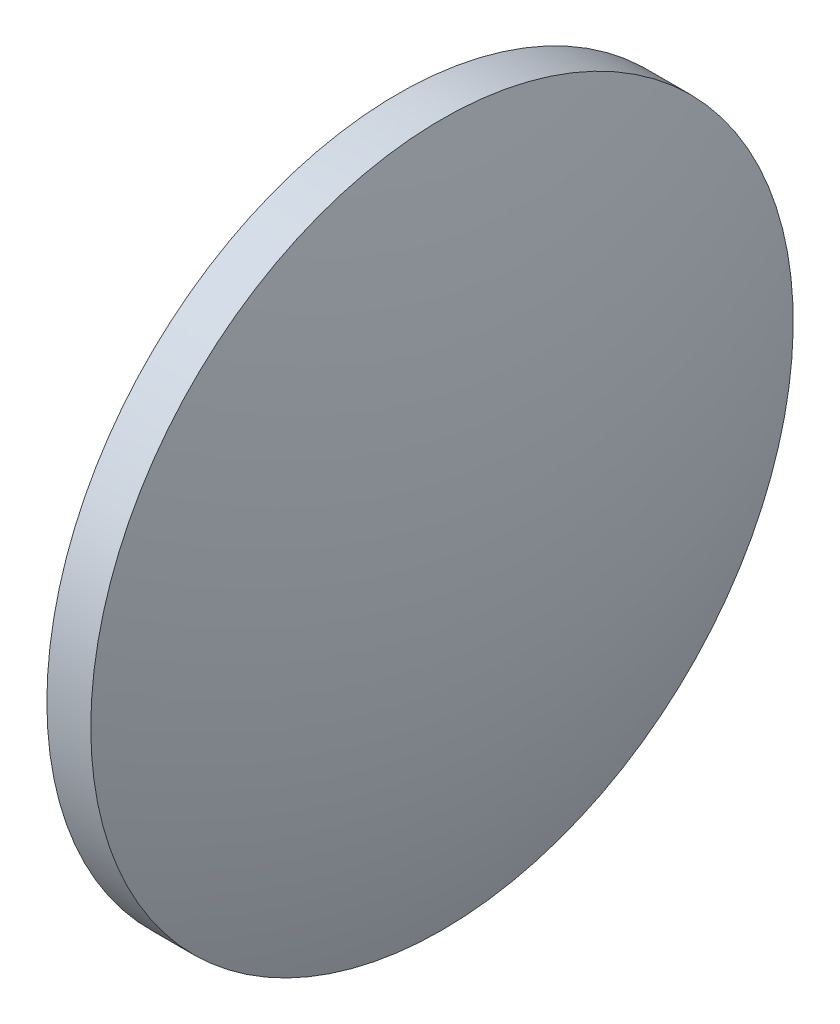
ISO-10303-21;
HEADER;
FILE_DESCRIPTION(('STEP AP214'),'2;1');
FILE_NAME('part.step','',(''),(''),'','','');
FILE_SCHEMA(('AUTOMOTIVE_DESIGN { 1 0 10303 214 1 1 1 1 }'));
ENDSEC;
DATA;
#1=APPLICATION_CONTEXT('core data for automotive mechanical design processes');
#2=APPLICATION_PROTOCOL_DEFINITION('international standard','automotive_design',2000,#1);
#3=PRODUCT_CONTEXT('',#1,'mechanical');
#4=PRODUCT('Part','Part','',(#3));
#5=PRODUCT_RELATED_PRODUCT_CATEGORY('part','',(#4));
#6=PRODUCT_DEFINITION_FORMATION('','',#4);
#7=PRODUCT_DEFINITION_CONTEXT('part definition',#1,'design');
#8=PRODUCT_DEFINITION('design','',#6,#7);
#9=PRODUCT_DEFINITION_SHAPE('','',#8);
#10=(LENGTH_UNIT() NAMED_UNIT(*) SI_UNIT(.MILLI.,.METRE.));
#11=(NAMED_UNIT(*) PLANE_ANGLE_UNIT() SI_UNIT($,.RADIAN.));
#12=(NAMED_UNIT(*) SI_UNIT($,.STERADIAN.) SOLID_ANGLE_UNIT());
#13=UNCERTAINTY_MEASURE_WITH_UNIT(LENGTH_MEASURE(1.E-05),#10,'distance_accuracy_value','');
#14=(GEOMETRIC_REPRESENTATION_CONTEXT(3) GLOBAL_UNCERTAINTY_ASSIGNED_CONTEXT((#13)) GLOBAL_UNIT_ASSIGNED_CONTEXT((#10,
#11,#12)) REPRESENTATION_CONTEXT('',''));
#15=CARTESIAN_POINT('',(0.,0.,0.));
#16=DIRECTION('',(0.,0.,1.));
#17=DIRECTION('',(1.,0.,0.));
#18=AXIS2_PLACEMENT_3D('',#15,#16,#17);
#19=CARTESIAN_POINT('',(567.820118258905,80.1894677279949,0.));
#20=DIRECTION('',(-1.,0.,0.));
#21=DIRECTION('',(0.,-1.,0.));
#22=AXIS2_PLACEMENT_3D('',#19,#20,#21);
#23=SPHERICAL_SURFACE('',#22,64.4830817610065);
#24=CARTESIAN_POINT('',(629.123200019912,80.1894677279948,0.));
#25=DIRECTION('',(-1.,0.,0.));
#26=DIRECTION('',(0.,0.,1.));
#27=AXIS2_PLACEMENT_3D('',#24,#25,#26);
#28=CIRCLE('',#27,20.);
#29=CARTESIAN_POINT('',(629.123200019912,80.1894677279948,20.));
#30=VERTEX_POINT('',#29);
#31=EDGE_CURVE('E10',#30,#30,#28,.T.);
#32=ORIENTED_EDGE('',*,*,#31,.F.);
#33=EDGE_LOOP('',(#32));
#34=FACE_BOUND('',#33,.T.);
#35=ADVANCED_FACE('F35',(#34),#23,.T.);
#36=CARTESIAN_POINT('',(621.928656839335,80.1894677279948,0.));
#37=DIRECTION('',(-1.,0.,0.));
#38=DIRECTION('',(0.,0.,1.));
#39=AXIS2_PLACEMENT_3D('',#36,#37,#38);
#40=CYLINDRICAL_SURFACE('',#39,20.);
#41=CARTESIAN_POINT('',(626.623200019912,80.1894677279948,0.));
#42=DIRECTION('',(-1.,0.,0.));
#43=DIRECTION('',(0.,0.,1.));
#44=AXIS2_PLACEMENT_3D('',#41,#42,#43);
#45=CIRCLE('',#44,20.);
#46=CARTESIAN_POINT('',(626.623200019912,80.1894677279948,20.));
#47=VERTEX_POINT('',#46);
#48=EDGE_CURVE('E41',#47,#47,#45,.T.);
#49=ORIENTED_EDGE('',*,*,#48,.F.);
#50=EDGE_LOOP('',(#49));
#51=FACE_BOUND('',#50,.T.);
#52=ORIENTED_EDGE('',*,*,#31,.T.);
#53=EDGE_LOOP('',(#52));
#54=FACE_BOUND('',#53,.T.);
#55=ADVANCED_FACE('F49',(#51,#54),#40,.T.);
#56=CARTESIAN_POINT('',(626.623200019912,80.1894677279948,0.));
#57=DIRECTION('',(1.,0.,0.));
#58=DIRECTION('',(0.,0.,-1.));
#59=AXIS2_PLACEMENT_3D('',#56,#57,#58);
#60=PLANE('',#59);
#61=ORIENTED_EDGE('',*,*,#48,.T.);
#62=EDGE_LOOP('',(#61));
#63=FACE_BOUND('',#62,.T.);
#64=ADVANCED_FACE('F47',(#63),#60,.F.);
#65=CLOSED_SHELL('',(#35,#55,#64));
#66=MANIFOLD_SOLID_BREP('B2',#65);
#67=ADVANCED_BREP_SHAPE_REPRESENTATION('',(#18,#66),#14);
#68=SHAPE_DEFINITION_REPRESENTATION(#9,#67);
ENDSEC;
END-ISO-10303-21;
